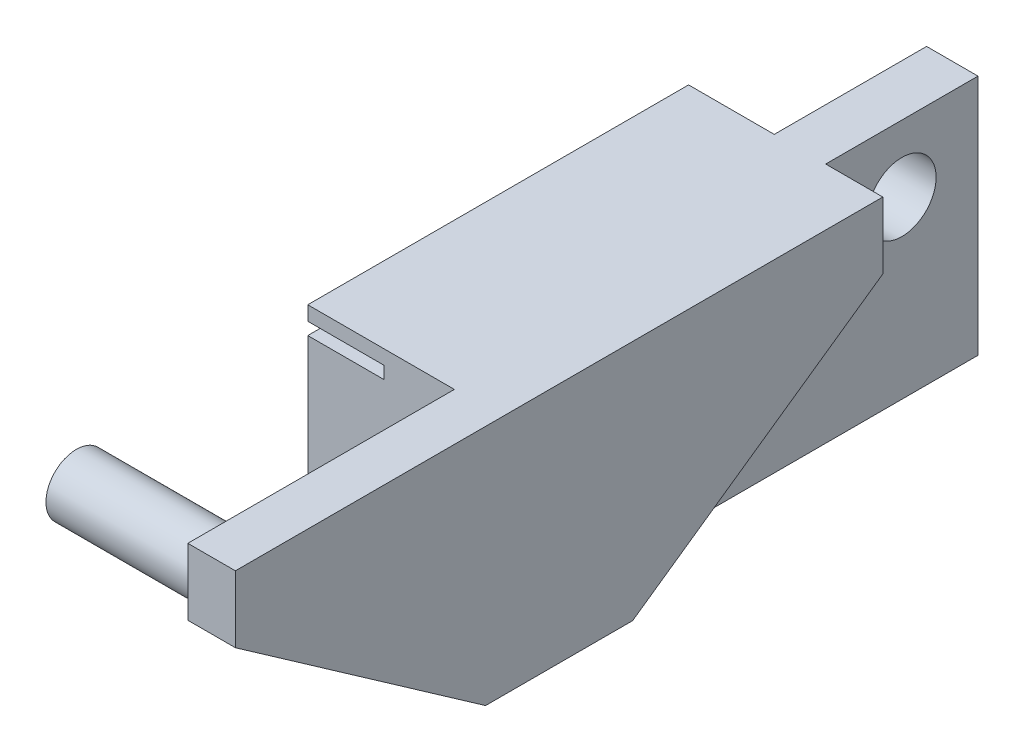
ISO-10303-21;
HEADER;
FILE_DESCRIPTION(('STEP AP214'),'2;1');
FILE_NAME('part.step','',(''),(''),'','','');
FILE_SCHEMA(('AUTOMOTIVE_DESIGN { 1 0 10303 214 1 1 1 1 }'));
ENDSEC;
DATA;
#1=APPLICATION_CONTEXT('core data for automotive mechanical design processes');
#2=APPLICATION_PROTOCOL_DEFINITION('international standard','automotive_design',2000,#1);
#3=PRODUCT_CONTEXT('',#1,'mechanical');
#4=PRODUCT('Part','Part','',(#3));
#5=PRODUCT_RELATED_PRODUCT_CATEGORY('part','',(#4));
#6=PRODUCT_DEFINITION_FORMATION('','',#4);
#7=PRODUCT_DEFINITION_CONTEXT('part definition',#1,'design');
#8=PRODUCT_DEFINITION('design','',#6,#7);
#9=PRODUCT_DEFINITION_SHAPE('','',#8);
#10=(LENGTH_UNIT() NAMED_UNIT(*) SI_UNIT(.MILLI.,.METRE.));
#11=(NAMED_UNIT(*) PLANE_ANGLE_UNIT() SI_UNIT($,.RADIAN.));
#12=(NAMED_UNIT(*) SI_UNIT($,.STERADIAN.) SOLID_ANGLE_UNIT());
#13=UNCERTAINTY_MEASURE_WITH_UNIT(LENGTH_MEASURE(1.E-05),#10,'distance_accuracy_value','');
#14=(GEOMETRIC_REPRESENTATION_CONTEXT(3) GLOBAL_UNCERTAINTY_ASSIGNED_CONTEXT((#13)) GLOBAL_UNIT_ASSIGNED_CONTEXT((#10,
#11,#12)) REPRESENTATION_CONTEXT('',''));
#15=CARTESIAN_POINT('',(0.,0.,0.));
#16=DIRECTION('',(0.,0.,1.));
#17=DIRECTION('',(1.,0.,0.));
#18=AXIS2_PLACEMENT_3D('',#15,#16,#17);
#19=CARTESIAN_POINT('',(-28.7781796503859,-0.00999999999999959,18.4558038197349));
#20=DIRECTION('',(1.,0.,0.));
#21=DIRECTION('',(0.,0.,-1.));
#22=AXIS2_PLACEMENT_3D('',#19,#20,#21);
#23=PLANE('',#22);
#24=CARTESIAN_POINT('',(-28.7781796503859,9.2,-12.2941961802651));
#25=DIRECTION('',(1.,0.,0.));
#26=DIRECTION('',(0.,0.,-1.));
#27=AXIS2_PLACEMENT_3D('',#24,#25,#26);
#28=CIRCLE('',#27,1.6);
#29=CARTESIAN_POINT('',(-28.7781796503859,9.2,-13.8941961802651));
#30=VERTEX_POINT('',#29);
#31=EDGE_CURVE('E454',#30,#30,#28,.F.);
#32=ORIENTED_EDGE('',*,*,#31,.F.);
#33=EDGE_LOOP('',(#32));
#34=FACE_BOUND('',#33,.T.);
#35=DIRECTION('',(0.,-1.,0.));
#36=VECTOR('',#35,1.);
#37=CARTESIAN_POINT('',(-28.7781796503859,12.7,4.45580381973494));
#38=LINE('',#37,#36);
#39=CARTESIAN_POINT('',(-28.7781796503859,11.3,4.45580381973494));
#40=VERTEX_POINT('',#39);
#41=CARTESIAN_POINT('',(-28.7781796503859,0.,4.45580381973494));
#42=VERTEX_POINT('',#41);
#43=EDGE_CURVE('E437',#40,#42,#38,.T.);
#44=ORIENTED_EDGE('',*,*,#43,.F.);
#45=DIRECTION('',(0.,0.,1.));
#46=VECTOR('',#45,1.);
#47=CARTESIAN_POINT('',(-28.7781796503859,11.3,4.45580381973494));
#48=LINE('',#47,#46);
#49=CARTESIAN_POINT('',(-28.7781796503859,11.3,-5.54419618026506));
#50=VERTEX_POINT('',#49);
#51=EDGE_CURVE('E250',#50,#40,#48,.T.);
#52=ORIENTED_EDGE('',*,*,#51,.F.);
#53=DIRECTION('',(0.,-1.,0.));
#54=VECTOR('',#53,1.);
#55=CARTESIAN_POINT('',(-28.7781796503859,11.3,-5.54419618026506));
#56=LINE('',#55,#54);
#57=CARTESIAN_POINT('',(-28.7781796503859,11.5,-5.54419618026506));
#58=VERTEX_POINT('',#57);
#59=EDGE_CURVE('E538',#58,#50,#56,.T.);
#60=ORIENTED_EDGE('',*,*,#59,.F.);
#61=DIRECTION('',(0.,0.,1.));
#62=VECTOR('',#61,1.);
#63=CARTESIAN_POINT('',(-28.7781796503859,11.5,-15.5441961802651));
#64=LINE('',#63,#62);
#65=CARTESIAN_POINT('',(-28.7781796503859,11.5,-15.5441961802651));
#66=VERTEX_POINT('',#65);
#67=EDGE_CURVE('E294',#66,#58,#64,.T.);
#68=ORIENTED_EDGE('',*,*,#67,.F.);
#69=DIRECTION('',(0.,-1.,0.));
#70=VECTOR('',#69,1.);
#71=CARTESIAN_POINT('',(-28.7781796503859,12.7,-15.5441961802651));
#72=LINE('',#71,#70);
#73=CARTESIAN_POINT('',(-28.7781796503859,9.2,-15.5441961802651));
#74=VERTEX_POINT('',#73);
#75=EDGE_CURVE('E450',#66,#74,#72,.T.);
#76=ORIENTED_EDGE('',*,*,#75,.T.);
#77=DIRECTION('',(0.,-0.57357643635105,0.819152044288989));
#78=VECTOR('',#77,1.);
#79=CARTESIAN_POINT('',(-28.7781796503859,9.2,-15.5441961802651));
#80=LINE('',#79,#78);
#81=CARTESIAN_POINT('',(-28.7781796503859,0.,-2.40523451823775));
#82=VERTEX_POINT('',#81);
#83=EDGE_CURVE('E446',#74,#82,#80,.T.);
#84=ORIENTED_EDGE('',*,*,#83,.T.);
#85=DIRECTION('',(0.,0.,-1.));
#86=VECTOR('',#85,1.);
#87=CARTESIAN_POINT('',(-28.7781796503859,0.,0.));
#88=LINE('',#87,#86);
#89=EDGE_CURVE('E442',#42,#82,#88,.T.);
#90=ORIENTED_EDGE('',*,*,#89,.F.);
#91=EDGE_LOOP('',(#44,#52,#60,#68,#76,#84,#90));
#92=FACE_BOUND('',#91,.T.);
#93=ADVANCED_FACE('F45',(#34,#92),#23,.F.);
#94=DIRECTION('',(0.,1.,0.));
#95=VECTOR('',#94,1.);
#96=CARTESIAN_POINT('',(-28.7781796503859,11.5,-5.54419618026507));
#97=LINE('',#96,#95);
#98=CARTESIAN_POINT('',(-28.7781796503859,11.95,-5.54419618026506));
#99=VERTEX_POINT('',#98);
#100=CARTESIAN_POINT('',(-28.7781796503859,12.15,-5.54419618026507));
#101=VERTEX_POINT('',#100);
#102=EDGE_CURVE('E318',#99,#101,#97,.T.);
#103=ORIENTED_EDGE('',*,*,#102,.F.);
#104=DIRECTION('',(0.,0.,-1.));
#105=VECTOR('',#104,1.);
#106=CARTESIAN_POINT('',(-28.7781796503859,11.95,4.45580381973494));
#107=LINE('',#106,#105);
#108=CARTESIAN_POINT('',(-28.7781796503859,11.95,4.45580381973494));
#109=VERTEX_POINT('',#108);
#110=EDGE_CURVE('E540',#109,#99,#107,.T.);
#111=ORIENTED_EDGE('',*,*,#110,.F.);
#112=CARTESIAN_POINT('',(-28.7781796503859,12.7,4.45580381973494));
#113=VERTEX_POINT('',#112);
#114=EDGE_CURVE('E255',#113,#109,#38,.T.);
#115=ORIENTED_EDGE('',*,*,#114,.F.);
#116=DIRECTION('',(0.,0.,-1.));
#117=VECTOR('',#116,1.);
#118=CARTESIAN_POINT('',(-28.7781796503859,12.7,0.));
#119=LINE('',#118,#117);
#120=CARTESIAN_POINT('',(-28.7781796503859,12.7,-15.5441961802651));
#121=VERTEX_POINT('',#120);
#122=EDGE_CURVE('E443',#113,#121,#119,.T.);
#123=ORIENTED_EDGE('',*,*,#122,.T.);
#124=CARTESIAN_POINT('',(-28.7781796503859,12.15,-15.5441961802651));
#125=VERTEX_POINT('',#124);
#126=EDGE_CURVE('E447',#121,#125,#72,.T.);
#127=ORIENTED_EDGE('',*,*,#126,.T.);
#128=DIRECTION('',(0.,0.,-1.));
#129=VECTOR('',#128,1.);
#130=CARTESIAN_POINT('',(-28.7781796503859,12.15,-15.5441961802651));
#131=LINE('',#130,#129);
#132=EDGE_CURVE('E306',#101,#125,#131,.T.);
#133=ORIENTED_EDGE('',*,*,#132,.F.);
#134=EDGE_LOOP('',(#103,#111,#115,#123,#127,#133));
#135=FACE_BOUND('',#134,.T.);
#136=ADVANCED_FACE('F47',(#135),#23,.F.);
#137=CARTESIAN_POINT('',(0.,0.,0.));
#138=DIRECTION('',(0.,1.,0.));
#139=DIRECTION('',(0.,0.,1.));
#140=AXIS2_PLACEMENT_3D('',#137,#138,#139);
#141=PLANE('',#140);
#142=DIRECTION('',(0.,0.,1.));
#143=VECTOR('',#142,1.);
#144=CARTESIAN_POINT('',(-21.5781796503859,0.,0.));
#145=LINE('',#144,#143);
#146=CARTESIAN_POINT('',(-21.5781796503859,0.,-23.5441961802651));
#147=VERTEX_POINT('',#146);
#148=CARTESIAN_POINT('',(-21.5781796503859,0.,-2.40523451823775));
#149=VERTEX_POINT('',#148);
#150=EDGE_CURVE('E413',#147,#149,#145,.T.);
#151=ORIENTED_EDGE('',*,*,#150,.T.);
#152=DIRECTION('',(1.,0.,0.));
#153=VECTOR('',#152,1.);
#154=CARTESIAN_POINT('',(-21.5781796503859,0.,-2.40523451823775));
#155=LINE('',#154,#153);
#156=CARTESIAN_POINT('',(-18.5781796503859,0.,-2.40523451823775));
#157=VERTEX_POINT('',#156);
#158=EDGE_CURVE('E360',#149,#157,#155,.T.);
#159=ORIENTED_EDGE('',*,*,#158,.T.);
#160=DIRECTION('',(0.,0.,1.));
#161=VECTOR('',#160,1.);
#162=CARTESIAN_POINT('',(-18.5781796503859,0.,0.));
#163=LINE('',#162,#161);
#164=CARTESIAN_POINT('',(-18.5781796503859,0.,5.31684215770762));
#165=VERTEX_POINT('',#164);
#166=EDGE_CURVE('E411',#157,#165,#163,.T.);
#167=ORIENTED_EDGE('',*,*,#166,.T.);
#168=DIRECTION('',(1.,0.,0.));
#169=VECTOR('',#168,1.);
#170=CARTESIAN_POINT('',(0.,0.,5.31684215770762));
#171=LINE('',#170,#169);
#172=CARTESIAN_POINT('',(-21.0781796503859,0.,5.31684215770762));
#173=VERTEX_POINT('',#172);
#174=EDGE_CURVE('E439',#173,#165,#171,.T.);
#175=ORIENTED_EDGE('',*,*,#174,.F.);
#176=DIRECTION('',(0.,0.,1.));
#177=VECTOR('',#176,1.);
#178=CARTESIAN_POINT('',(-21.0781796503859,0.,0.));
#179=LINE('',#178,#177);
#180=CARTESIAN_POINT('',(-21.0781796503859,0.,4.45580381973494));
#181=VERTEX_POINT('',#180);
#182=EDGE_CURVE('E408',#181,#173,#179,.T.);
#183=ORIENTED_EDGE('',*,*,#182,.F.);
#184=DIRECTION('',(1.,0.,0.));
#185=VECTOR('',#184,1.);
#186=CARTESIAN_POINT('',(0.,0.,4.45580381973494));
#187=LINE('',#186,#185);
#188=EDGE_CURVE('E386',#42,#181,#187,.T.);
#189=ORIENTED_EDGE('',*,*,#188,.F.);
#190=ORIENTED_EDGE('',*,*,#89,.T.);
#191=DIRECTION('',(-1.,0.,0.));
#192=VECTOR('',#191,1.);
#193=CARTESIAN_POINT('',(-28.2781796503859,0.,-2.40523451823775));
#194=LINE('',#193,#192);
#195=CARTESIAN_POINT('',(-28.2781796503859,0.,-2.40523451823775));
#196=VERTEX_POINT('',#195);
#197=EDGE_CURVE('E356',#196,#82,#194,.T.);
#198=ORIENTED_EDGE('',*,*,#197,.F.);
#199=DIRECTION('',(0.,0.,1.));
#200=VECTOR('',#199,1.);
#201=CARTESIAN_POINT('',(-28.2781796503859,0.,0.));
#202=LINE('',#201,#200);
#203=CARTESIAN_POINT('',(-28.2781796503859,0.,-15.5441961802651));
#204=VERTEX_POINT('',#203);
#205=EDGE_CURVE('E390',#204,#196,#202,.T.);
#206=ORIENTED_EDGE('',*,*,#205,.F.);
#207=DIRECTION('',(1.,0.,0.));
#208=VECTOR('',#207,1.);
#209=CARTESIAN_POINT('',(-28.2781796503859,0.,-15.5441961802651));
#210=LINE('',#209,#208);
#211=CARTESIAN_POINT('',(-24.2781796503859,0.,-15.5441961802651));
#212=VERTEX_POINT('',#211);
#213=EDGE_CURVE('E331',#204,#212,#210,.T.);
#214=ORIENTED_EDGE('',*,*,#213,.T.);
#215=DIRECTION('',(0.,0.,-1.));
#216=VECTOR('',#215,1.);
#217=CARTESIAN_POINT('',(-24.2781796503859,0.,-23.5441961802651));
#218=LINE('',#217,#216);
#219=CARTESIAN_POINT('',(-24.2781796503859,0.,-23.5441961802651));
#220=VERTEX_POINT('',#219);
#221=EDGE_CURVE('E334',#212,#220,#218,.T.);
#222=ORIENTED_EDGE('',*,*,#221,.T.);
#223=DIRECTION('',(1.,0.,0.));
#224=VECTOR('',#223,1.);
#225=CARTESIAN_POINT('',(0.,0.,-23.5441961802651));
#226=LINE('',#225,#224);
#227=CARTESIAN_POINT('',(-23.6781796503859,0.,-23.5441961802651));
#228=VERTEX_POINT('',#227);
#229=EDGE_CURVE('E416',#220,#228,#226,.T.);
#230=ORIENTED_EDGE('',*,*,#229,.T.);
#231=DIRECTION('',(0.,0.,-1.));
#232=VECTOR('',#231,1.);
#233=CARTESIAN_POINT('',(-23.6781796503859,0.,4.45580381973494));
#234=LINE('',#233,#232);
#235=CARTESIAN_POINT('',(-23.6781796503859,0.,-2.40523451823775));
#236=VERTEX_POINT('',#235);
#237=EDGE_CURVE('E276',#236,#228,#234,.T.);
#238=ORIENTED_EDGE('',*,*,#237,.F.);
#239=DIRECTION('',(1.,0.,0.));
#240=VECTOR('',#239,1.);
#241=CARTESIAN_POINT('',(-28.7781796503859,0.,-2.40523451823775));
#242=LINE('',#241,#240);
#243=CARTESIAN_POINT('',(-22.1781796503859,0.,-2.40523451823775));
#244=VERTEX_POINT('',#243);
#245=EDGE_CURVE('E267',#236,#244,#242,.T.);
#246=ORIENTED_EDGE('',*,*,#245,.T.);
#247=DIRECTION('',(0.,0.,1.));
#248=VECTOR('',#247,1.);
#249=CARTESIAN_POINT('',(-22.1781796503859,0.,4.45580381973494));
#250=LINE('',#249,#248);
#251=CARTESIAN_POINT('',(-22.1781796503859,0.,-23.5441961802651));
#252=VERTEX_POINT('',#251);
#253=EDGE_CURVE('E280',#252,#244,#250,.T.);
#254=ORIENTED_EDGE('',*,*,#253,.F.);
#255=EDGE_CURVE('E415',#252,#147,#226,.T.);
#256=ORIENTED_EDGE('',*,*,#255,.T.);
#257=EDGE_LOOP('',(#151,#159,#167,#175,#183,#189,#190,#198,#206,#214,#222,#230,#238,#246,#254,#256));
#258=FACE_BOUND('',#257,.T.);
#259=ADVANCED_FACE('F476',(#258),#141,.F.);
#260=CARTESIAN_POINT('',(0.,12.7,-15.5441961802651));
#261=DIRECTION('',(0.,0.,-1.));
#262=DIRECTION('',(-1.,0.,0.));
#263=AXIS2_PLACEMENT_3D('',#260,#261,#262);
#264=PLANE('',#263);
#265=DIRECTION('',(-1.,0.,0.));
#266=VECTOR('',#265,1.);
#267=CARTESIAN_POINT('',(-28.1281796503859,12.15,-15.5441961802651));
#268=LINE('',#267,#266);
#269=CARTESIAN_POINT('',(-28.1281796503859,12.15,-15.5441961802651));
#270=VERTEX_POINT('',#269);
#271=EDGE_CURVE('E321',#270,#125,#268,.T.);
#272=ORIENTED_EDGE('',*,*,#271,.T.);
#273=ORIENTED_EDGE('',*,*,#126,.F.);
#274=DIRECTION('',(1.,0.,0.));
#275=VECTOR('',#274,1.);
#276=CARTESIAN_POINT('',(0.,12.7,-15.5441961802651));
#277=LINE('',#276,#275);
#278=CARTESIAN_POINT('',(-24.2781796503859,12.7,-15.5441961802651));
#279=VERTEX_POINT('',#278);
#280=EDGE_CURVE('E401',#121,#279,#277,.T.);
#281=ORIENTED_EDGE('',*,*,#280,.T.);
#282=DIRECTION('',(0.,1.,0.));
#283=VECTOR('',#282,1.);
#284=CARTESIAN_POINT('',(-24.2781796503859,0.,-15.5441961802651));
#285=LINE('',#284,#283);
#286=EDGE_CURVE('E343',#212,#279,#285,.T.);
#287=ORIENTED_EDGE('',*,*,#286,.F.);
#288=ORIENTED_EDGE('',*,*,#213,.F.);
#289=DIRECTION('',(0.,1.,0.));
#290=VECTOR('',#289,1.);
#291=CARTESIAN_POINT('',(-28.2781796503859,0.,-15.5441961802651));
#292=LINE('',#291,#290);
#293=CARTESIAN_POINT('',(-28.2781796503859,9.2,-15.5441961802651));
#294=VERTEX_POINT('',#293);
#295=EDGE_CURVE('E337',#204,#294,#292,.T.);
#296=ORIENTED_EDGE('',*,*,#295,.T.);
#297=DIRECTION('',(-1.,0.,0.));
#298=VECTOR('',#297,1.);
#299=CARTESIAN_POINT('',(-28.2781796503859,9.2,-15.5441961802651));
#300=LINE('',#299,#298);
#301=EDGE_CURVE('E357',#294,#74,#300,.T.);
#302=ORIENTED_EDGE('',*,*,#301,.T.);
#303=ORIENTED_EDGE('',*,*,#75,.F.);
#304=DIRECTION('',(-1.,0.,0.));
#305=VECTOR('',#304,1.);
#306=CARTESIAN_POINT('',(-28.1281796503859,11.5,-15.5441961802651));
#307=LINE('',#306,#305);
#308=CARTESIAN_POINT('',(-28.1281796503859,11.5,-15.5441961802651));
#309=VERTEX_POINT('',#308);
#310=EDGE_CURVE('E315',#309,#66,#307,.T.);
#311=ORIENTED_EDGE('',*,*,#310,.F.);
#312=DIRECTION('',(0.,-1.,0.));
#313=VECTOR('',#312,1.);
#314=CARTESIAN_POINT('',(-28.1281796503859,11.5,-15.5441961802651));
#315=LINE('',#314,#313);
#316=EDGE_CURVE('E302',#270,#309,#315,.T.);
#317=ORIENTED_EDGE('',*,*,#316,.F.);
#318=EDGE_LOOP('',(#272,#273,#281,#287,#288,#296,#302,#303,#311,#317));
#319=FACE_BOUND('',#318,.T.);
#320=ADVANCED_FACE('F511',(#319),#264,.T.);
#321=CARTESIAN_POINT('',(-21.0781796503859,12.7,0.));
#322=DIRECTION('',(1.,0.,0.));
#323=DIRECTION('',(0.,0.,-1.));
#324=AXIS2_PLACEMENT_3D('',#321,#322,#323);
#325=PLANE('',#324);
#326=CARTESIAN_POINT('',(-21.0781796503859,9.2,15.2058038197349));
#327=DIRECTION('',(1.,0.,0.));
#328=DIRECTION('',(0.,0.,-1.));
#329=AXIS2_PLACEMENT_3D('',#326,#327,#328);
#330=CIRCLE('',#329,1.6);
#331=CARTESIAN_POINT('',(-21.0781796503859,9.2,13.6058038197349));
#332=VERTEX_POINT('',#331);
#333=EDGE_CURVE('E380',#332,#332,#330,.T.);
#334=ORIENTED_EDGE('',*,*,#333,.T.);
#335=EDGE_LOOP('',(#334));
#336=FACE_BOUND('',#335,.T.);
#337=DIRECTION('',(0.,-0.57357643635105,-0.819152044288989));
#338=VECTOR('',#337,1.);
#339=CARTESIAN_POINT('',(-21.0781796503859,1.68007341914141,7.71623566243481));
#340=LINE('',#339,#338);
#341=CARTESIAN_POINT('',(-21.0781796503859,9.2,18.4558038197349));
#342=VERTEX_POINT('',#341);
#343=EDGE_CURVE('E370',#342,#173,#340,.T.);
#344=ORIENTED_EDGE('',*,*,#343,.F.);
#345=DIRECTION('',(0.,-1.,0.));
#346=VECTOR('',#345,1.);
#347=CARTESIAN_POINT('',(-21.0781796503859,12.7,18.4558038197349));
#348=LINE('',#347,#346);
#349=CARTESIAN_POINT('',(-21.0781796503859,12.7,18.4558038197349));
#350=VERTEX_POINT('',#349);
#351=EDGE_CURVE('E432',#350,#342,#348,.T.);
#352=ORIENTED_EDGE('',*,*,#351,.F.);
#353=DIRECTION('',(0.,0.,1.));
#354=VECTOR('',#353,1.);
#355=CARTESIAN_POINT('',(-21.0781796503859,12.7,0.));
#356=LINE('',#355,#354);
#357=CARTESIAN_POINT('',(-21.0781796503859,12.7,4.45580381973494));
#358=VERTEX_POINT('',#357);
#359=EDGE_CURVE('E389',#358,#350,#356,.T.);
#360=ORIENTED_EDGE('',*,*,#359,.F.);
#361=DIRECTION('',(0.,-1.,0.));
#362=VECTOR('',#361,1.);
#363=CARTESIAN_POINT('',(-21.0781796503859,12.7,4.45580381973494));
#364=LINE('',#363,#362);
#365=EDGE_CURVE('E435',#358,#181,#364,.T.);
#366=ORIENTED_EDGE('',*,*,#365,.T.);
#367=ORIENTED_EDGE('',*,*,#182,.T.);
#368=EDGE_LOOP('',(#344,#352,#360,#366,#367));
#369=FACE_BOUND('',#368,.T.);
#370=ADVANCED_FACE('F560',(#336,#369),#325,.F.);
#371=CARTESIAN_POINT('',(0.,12.7,18.4558038197349));
#372=DIRECTION('',(0.,0.,-1.));
#373=DIRECTION('',(-1.,0.,0.));
#374=AXIS2_PLACEMENT_3D('',#371,#372,#373);
#375=PLANE('',#374);
#376=DIRECTION('',(1.,0.,0.));
#377=VECTOR('',#376,1.);
#378=CARTESIAN_POINT('',(-21.5781796503859,9.2,18.4558038197349));
#379=LINE('',#378,#377);
#380=CARTESIAN_POINT('',(-18.5781796503859,9.2,18.4558038197349));
#381=VERTEX_POINT('',#380);
#382=EDGE_CURVE('E366',#342,#381,#379,.T.);
#383=ORIENTED_EDGE('',*,*,#382,.T.);
#384=DIRECTION('',(0.,-1.,0.));
#385=VECTOR('',#384,1.);
#386=CARTESIAN_POINT('',(-18.5781796503859,12.7,18.4558038197349));
#387=LINE('',#386,#385);
#388=CARTESIAN_POINT('',(-18.5781796503859,12.7,18.4558038197349));
#389=VERTEX_POINT('',#388);
#390=EDGE_CURVE('E429',#389,#381,#387,.T.);
#391=ORIENTED_EDGE('',*,*,#390,.F.);
#392=DIRECTION('',(1.,0.,0.));
#393=VECTOR('',#392,1.);
#394=CARTESIAN_POINT('',(0.,12.7,18.4558038197349));
#395=LINE('',#394,#393);
#396=EDGE_CURVE('E392',#350,#389,#395,.T.);
#397=ORIENTED_EDGE('',*,*,#396,.F.);
#398=ORIENTED_EDGE('',*,*,#351,.T.);
#399=EDGE_LOOP('',(#383,#391,#397,#398));
#400=FACE_BOUND('',#399,.T.);
#401=ADVANCED_FACE('F512',(#400),#375,.F.);
#402=CARTESIAN_POINT('',(-18.5781796503859,12.7,0.));
#403=DIRECTION('',(1.,0.,0.));
#404=DIRECTION('',(0.,0.,-1.));
#405=AXIS2_PLACEMENT_3D('',#402,#403,#404);
#406=PLANE('',#405);
#407=DIRECTION('',(0.,-0.57357643635105,-0.819152044288989));
#408=VECTOR('',#407,1.);
#409=CARTESIAN_POINT('',(-18.5781796503859,9.2,18.4558038197349));
#410=LINE('',#409,#408);
#411=EDGE_CURVE('E363',#381,#165,#410,.T.);
#412=ORIENTED_EDGE('',*,*,#411,.T.);
#413=ORIENTED_EDGE('',*,*,#166,.F.);
#414=DIRECTION('',(0.,-0.57357643635105,0.819152044288989));
#415=VECTOR('',#414,1.);
#416=CARTESIAN_POINT('',(-18.5781796503859,9.2,-15.5441961802651));
#417=LINE('',#416,#415);
#418=CARTESIAN_POINT('',(-18.5781796503859,9.2,-15.5441961802651));
#419=VERTEX_POINT('',#418);
#420=EDGE_CURVE('E367',#419,#157,#417,.T.);
#421=ORIENTED_EDGE('',*,*,#420,.F.);
#422=DIRECTION('',(0.,-1.,0.));
#423=VECTOR('',#422,1.);
#424=CARTESIAN_POINT('',(-18.5781796503859,12.7,-15.5441961802651));
#425=LINE('',#424,#423);
#426=CARTESIAN_POINT('',(-18.5781796503859,12.7,-15.5441961802651));
#427=VERTEX_POINT('',#426);
#428=EDGE_CURVE('E426',#427,#419,#425,.T.);
#429=ORIENTED_EDGE('',*,*,#428,.F.);
#430=DIRECTION('',(0.,0.,1.));
#431=VECTOR('',#430,1.);
#432=CARTESIAN_POINT('',(-18.5781796503859,12.7,0.));
#433=LINE('',#432,#431);
#434=EDGE_CURVE('E394',#427,#389,#433,.T.);
#435=ORIENTED_EDGE('',*,*,#434,.T.);
#436=ORIENTED_EDGE('',*,*,#390,.T.);
#437=EDGE_LOOP('',(#412,#413,#421,#429,#435,#436));
#438=FACE_BOUND('',#437,.T.);
#439=ADVANCED_FACE('F504',(#438),#406,.T.);
#440=CARTESIAN_POINT('',(0.,12.7,4.45580381973494));
#441=DIRECTION('',(0.,0.,-1.));
#442=DIRECTION('',(-1.,0.,0.));
#443=AXIS2_PLACEMENT_3D('',#440,#441,#442);
#444=PLANE('',#443);
#445=DIRECTION('',(0.,-1.,0.));
#446=VECTOR('',#445,1.);
#447=CARTESIAN_POINT('',(-22.1781796503859,3.,4.45580381973494));
#448=LINE('',#447,#446);
#449=CARTESIAN_POINT('',(-22.1781796503859,3.,4.45580381973494));
#450=VERTEX_POINT('',#449);
#451=CARTESIAN_POINT('',(-22.1781796503859,1.,4.45580381973494));
#452=VERTEX_POINT('',#451);
#453=EDGE_CURVE('E295',#450,#452,#448,.T.);
#454=ORIENTED_EDGE('',*,*,#453,.T.);
#455=DIRECTION('',(-1.,0.,0.));
#456=VECTOR('',#455,1.);
#457=CARTESIAN_POINT('',(-28.7781796503859,1.,4.45580381973494));
#458=LINE('',#457,#456);
#459=CARTESIAN_POINT('',(-23.6781796503859,1.,4.45580381973494));
#460=VERTEX_POINT('',#459);
#461=EDGE_CURVE('E266',#452,#460,#458,.T.);
#462=ORIENTED_EDGE('',*,*,#461,.T.);
#463=DIRECTION('',(0.,-1.,0.));
#464=VECTOR('',#463,1.);
#465=CARTESIAN_POINT('',(-23.6781796503859,3.,4.45580381973494));
#466=LINE('',#465,#464);
#467=CARTESIAN_POINT('',(-23.6781796503859,3.,4.45580381973494));
#468=VERTEX_POINT('',#467);
#469=EDGE_CURVE('E292',#468,#460,#466,.T.);
#470=ORIENTED_EDGE('',*,*,#469,.F.);
#471=DIRECTION('',(-1.,0.,0.));
#472=VECTOR('',#471,1.);
#473=CARTESIAN_POINT('',(-23.6781796503859,3.,4.45580381973494));
#474=LINE('',#473,#472);
#475=EDGE_CURVE('E286',#450,#468,#474,.T.);
#476=ORIENTED_EDGE('',*,*,#475,.F.);
#477=EDGE_LOOP('',(#454,#462,#470,#476));
#478=FACE_BOUND('',#477,.T.);
#479=DIRECTION('',(0.,1.,0.));
#480=VECTOR('',#479,1.);
#481=CARTESIAN_POINT('',(-24.7781796503859,11.3,4.45580381973494));
#482=LINE('',#481,#480);
#483=CARTESIAN_POINT('',(-24.7781796503859,11.3,4.45580381973494));
#484=VERTEX_POINT('',#483);
#485=CARTESIAN_POINT('',(-24.7781796503859,11.95,4.45580381973494));
#486=VERTEX_POINT('',#485);
#487=EDGE_CURVE('E241',#484,#486,#482,.T.);
#488=ORIENTED_EDGE('',*,*,#487,.F.);
#489=DIRECTION('',(-1.,0.,0.));
#490=VECTOR('',#489,1.);
#491=CARTESIAN_POINT('',(-24.7781796503859,11.3,4.45580381973494));
#492=LINE('',#491,#490);
#493=EDGE_CURVE('E272',#484,#40,#492,.T.);
#494=ORIENTED_EDGE('',*,*,#493,.T.);
#495=ORIENTED_EDGE('',*,*,#43,.T.);
#496=ORIENTED_EDGE('',*,*,#188,.T.);
#497=ORIENTED_EDGE('',*,*,#365,.F.);
#498=DIRECTION('',(1.,0.,0.));
#499=VECTOR('',#498,1.);
#500=CARTESIAN_POINT('',(0.,12.7,4.45580381973494));
#501=LINE('',#500,#499);
#502=EDGE_CURVE('E387',#113,#358,#501,.T.);
#503=ORIENTED_EDGE('',*,*,#502,.F.);
#504=ORIENTED_EDGE('',*,*,#114,.T.);
#505=DIRECTION('',(-1.,0.,0.));
#506=VECTOR('',#505,1.);
#507=CARTESIAN_POINT('',(-24.7781796503859,11.95,4.45580381973494));
#508=LINE('',#507,#506);
#509=EDGE_CURVE('E236',#486,#109,#508,.T.);
#510=ORIENTED_EDGE('',*,*,#509,.F.);
#511=EDGE_LOOP('',(#488,#494,#495,#496,#497,#503,#504,#510));
#512=FACE_BOUND('',#511,.T.);
#513=ADVANCED_FACE('F253',(#478,#512),#444,.F.);
#514=DIRECTION('',(1.,0.,0.));
#515=VECTOR('',#514,1.);
#516=CARTESIAN_POINT('',(-21.5781796503859,9.2,-15.5441961802651));
#517=LINE('',#516,#515);
#518=CARTESIAN_POINT('',(-21.5781796503859,9.2,-15.5441961802651));
#519=VERTEX_POINT('',#518);
#520=EDGE_CURVE('E371',#519,#419,#517,.T.);
#521=ORIENTED_EDGE('',*,*,#520,.F.);
#522=DIRECTION('',(0.,-1.,0.));
#523=VECTOR('',#522,1.);
#524=CARTESIAN_POINT('',(-21.5781796503859,12.7,-15.5441961802651));
#525=LINE('',#524,#523);
#526=CARTESIAN_POINT('',(-21.5781796503859,12.7,-15.5441961802651));
#527=VERTEX_POINT('',#526);
#528=EDGE_CURVE('E423',#527,#519,#525,.T.);
#529=ORIENTED_EDGE('',*,*,#528,.F.);
#530=EDGE_CURVE('E397',#527,#427,#277,.T.);
#531=ORIENTED_EDGE('',*,*,#530,.T.);
#532=ORIENTED_EDGE('',*,*,#428,.T.);
#533=EDGE_LOOP('',(#521,#529,#531,#532));
#534=FACE_BOUND('',#533,.T.);
#535=ADVANCED_FACE('F503',(#534),#264,.T.);
#536=CARTESIAN_POINT('',(-21.5781796503859,12.7,0.));
#537=DIRECTION('',(1.,0.,0.));
#538=DIRECTION('',(0.,0.,-1.));
#539=AXIS2_PLACEMENT_3D('',#536,#537,#538);
#540=PLANE('',#539);
#541=CARTESIAN_POINT('',(-21.5781796503859,9.2,-19.5441961802651));
#542=DIRECTION('',(1.,0.,0.));
#543=DIRECTION('',(0.,0.,-1.));
#544=AXIS2_PLACEMENT_3D('',#541,#542,#543);
#545=CIRCLE('',#544,1.8);
#546=CARTESIAN_POINT('',(-21.5781796503859,9.2,-21.3441961802651));
#547=VERTEX_POINT('',#546);
#548=EDGE_CURVE('E383',#547,#547,#545,.T.);
#549=ORIENTED_EDGE('',*,*,#548,.F.);
#550=EDGE_LOOP('',(#549));
#551=FACE_BOUND('',#550,.T.);
#552=ORIENTED_EDGE('',*,*,#150,.F.);
#553=DIRECTION('',(0.,-1.,0.));
#554=VECTOR('',#553,1.);
#555=CARTESIAN_POINT('',(-21.5781796503859,12.7,-23.5441961802651));
#556=LINE('',#555,#554);
#557=CARTESIAN_POINT('',(-21.5781796503859,12.7,-23.5441961802651));
#558=VERTEX_POINT('',#557);
#559=EDGE_CURVE('E420',#558,#147,#556,.T.);
#560=ORIENTED_EDGE('',*,*,#559,.F.);
#561=DIRECTION('',(0.,0.,1.));
#562=VECTOR('',#561,1.);
#563=CARTESIAN_POINT('',(-21.5781796503859,12.7,0.));
#564=LINE('',#563,#562);
#565=EDGE_CURVE('E400',#558,#527,#564,.T.);
#566=ORIENTED_EDGE('',*,*,#565,.T.);
#567=ORIENTED_EDGE('',*,*,#528,.T.);
#568=DIRECTION('',(0.,-0.57357643635105,0.819152044288989));
#569=VECTOR('',#568,1.);
#570=CARTESIAN_POINT('',(-21.5781796503859,9.2,-15.5441961802651));
#571=LINE('',#570,#569);
#572=EDGE_CURVE('E373',#519,#149,#571,.T.);
#573=ORIENTED_EDGE('',*,*,#572,.T.);
#574=EDGE_LOOP('',(#552,#560,#566,#567,#573));
#575=FACE_BOUND('',#574,.T.);
#576=ADVANCED_FACE('F493',(#551,#575),#540,.T.);
#577=CARTESIAN_POINT('',(0.,12.7,-23.5441961802651));
#578=DIRECTION('',(0.,0.,-1.));
#579=DIRECTION('',(-1.,0.,0.));
#580=AXIS2_PLACEMENT_3D('',#577,#578,#579);
#581=PLANE('',#580);
#582=DIRECTION('',(0.,-1.,0.));
#583=VECTOR('',#582,1.);
#584=CARTESIAN_POINT('',(-23.6781796503859,3.,-23.5441961802651));
#585=LINE('',#584,#583);
#586=CARTESIAN_POINT('',(-23.6781796503859,3.,-23.5441961802651));
#587=VERTEX_POINT('',#586);
#588=EDGE_CURVE('E289',#587,#228,#585,.T.);
#589=ORIENTED_EDGE('',*,*,#588,.T.);
#590=ORIENTED_EDGE('',*,*,#229,.F.);
#591=DIRECTION('',(0.,1.,0.));
#592=VECTOR('',#591,1.);
#593=CARTESIAN_POINT('',(-24.2781796503859,0.,-23.5441961802651));
#594=LINE('',#593,#592);
#595=CARTESIAN_POINT('',(-24.2781796503859,12.7,-23.5441961802651));
#596=VERTEX_POINT('',#595);
#597=EDGE_CURVE('E339',#220,#596,#594,.T.);
#598=ORIENTED_EDGE('',*,*,#597,.T.);
#599=DIRECTION('',(1.,0.,0.));
#600=VECTOR('',#599,1.);
#601=CARTESIAN_POINT('',(0.,12.7,-23.5441961802651));
#602=LINE('',#601,#600);
#603=EDGE_CURVE('E404',#596,#558,#602,.T.);
#604=ORIENTED_EDGE('',*,*,#603,.T.);
#605=ORIENTED_EDGE('',*,*,#559,.T.);
#606=ORIENTED_EDGE('',*,*,#255,.F.);
#607=DIRECTION('',(0.,-1.,0.));
#608=VECTOR('',#607,1.);
#609=CARTESIAN_POINT('',(-22.1781796503859,3.,-23.5441961802651));
#610=LINE('',#609,#608);
#611=CARTESIAN_POINT('',(-22.1781796503859,3.,-23.5441961802651));
#612=VERTEX_POINT('',#611);
#613=EDGE_CURVE('E298',#612,#252,#610,.T.);
#614=ORIENTED_EDGE('',*,*,#613,.F.);
#615=DIRECTION('',(1.,0.,0.));
#616=VECTOR('',#615,1.);
#617=CARTESIAN_POINT('',(-23.6781796503859,3.,-23.5441961802651));
#618=LINE('',#617,#616);
#619=EDGE_CURVE('E279',#587,#612,#618,.T.);
#620=ORIENTED_EDGE('',*,*,#619,.F.);
#621=EDGE_LOOP('',(#589,#590,#598,#604,#605,#606,#614,#620));
#622=FACE_BOUND('',#621,.T.);
#623=ADVANCED_FACE('F474',(#622),#581,.T.);
#624=CARTESIAN_POINT('',(-28.2781796503859,12.7,0.));
#625=DIRECTION('',(1.,0.,0.));
#626=DIRECTION('',(0.,0.,-1.));
#627=AXIS2_PLACEMENT_3D('',#624,#625,#626);
#628=PLANE('',#627);
#629=DIRECTION('',(0.,-0.57357643635105,0.819152044288989));
#630=VECTOR('',#629,1.);
#631=CARTESIAN_POINT('',(-28.2781796503859,9.2,-15.5441961802651));
#632=LINE('',#631,#630);
#633=EDGE_CURVE('E353',#294,#196,#632,.T.);
#634=ORIENTED_EDGE('',*,*,#633,.F.);
#635=ORIENTED_EDGE('',*,*,#295,.F.);
#636=ORIENTED_EDGE('',*,*,#205,.T.);
#637=EDGE_LOOP('',(#634,#635,#636));
#638=FACE_BOUND('',#637,.T.);
#639=ADVANCED_FACE('F578',(#638),#628,.F.);
#640=CARTESIAN_POINT('',(0.,12.7,0.));
#641=DIRECTION('',(0.,1.,0.));
#642=DIRECTION('',(0.,0.,1.));
#643=AXIS2_PLACEMENT_3D('',#640,#641,#642);
#644=PLANE('',#643);
#645=DIRECTION('',(0.,0.,-1.));
#646=VECTOR('',#645,1.);
#647=CARTESIAN_POINT('',(-24.2781796503859,12.7,-23.5441961802651));
#648=LINE('',#647,#646);
#649=EDGE_CURVE('E324',#279,#596,#648,.T.);
#650=ORIENTED_EDGE('',*,*,#649,.F.);
#651=ORIENTED_EDGE('',*,*,#280,.F.);
#652=ORIENTED_EDGE('',*,*,#122,.F.);
#653=ORIENTED_EDGE('',*,*,#502,.T.);
#654=ORIENTED_EDGE('',*,*,#359,.T.);
#655=ORIENTED_EDGE('',*,*,#396,.T.);
#656=ORIENTED_EDGE('',*,*,#434,.F.);
#657=ORIENTED_EDGE('',*,*,#530,.F.);
#658=ORIENTED_EDGE('',*,*,#565,.F.);
#659=ORIENTED_EDGE('',*,*,#603,.F.);
#660=EDGE_LOOP('',(#650,#651,#652,#653,#654,#655,#656,#657,#658,#659));
#661=FACE_BOUND('',#660,.T.);
#662=ADVANCED_FACE('F487',(#661),#644,.T.);
#663=CARTESIAN_POINT('',(-31.2781796503859,9.2,-19.5441961802651));
#664=DIRECTION('',(1.,0.,0.));
#665=DIRECTION('',(0.,0.,-1.));
#666=AXIS2_PLACEMENT_3D('',#663,#664,#665);
#667=CYLINDRICAL_SURFACE('',#666,1.8);
#668=CARTESIAN_POINT('',(-24.2781796503859,9.2,-19.5441961802651));
#669=DIRECTION('',(1.,0.,0.));
#670=DIRECTION('',(0.,0.,-1.));
#671=AXIS2_PLACEMENT_3D('',#668,#669,#670);
#672=CIRCLE('',#671,1.8);
#673=CARTESIAN_POINT('',(-24.2781796503859,9.2,-21.3441961802651));
#674=VERTEX_POINT('',#673);
#675=EDGE_CURVE('E342',#674,#674,#672,.F.);
#676=ORIENTED_EDGE('',*,*,#675,.T.);
#677=EDGE_LOOP('',(#676));
#678=FACE_BOUND('',#677,.T.);
#679=ORIENTED_EDGE('',*,*,#548,.T.);
#680=EDGE_LOOP('',(#679));
#681=FACE_BOUND('',#680,.T.);
#682=ADVANCED_FACE('F585',(#678,#681),#667,.F.);
#683=CARTESIAN_POINT('',(-31.2801796503859,9.2,15.2058038197349));
#684=DIRECTION('',(1.,0.,0.));
#685=DIRECTION('',(0.,0.,-1.));
#686=AXIS2_PLACEMENT_3D('',#683,#684,#685);
#687=CYLINDRICAL_SURFACE('',#686,1.6);
#688=CARTESIAN_POINT('',(-30.1781796503859,9.2,15.2058038197349));
#689=DIRECTION('',(-1.,0.,0.));
#690=DIRECTION('',(0.,0.,1.));
#691=AXIS2_PLACEMENT_3D('',#688,#689,#690);
#692=CIRCLE('',#691,1.6);
#693=CARTESIAN_POINT('',(-30.1781796503859,9.2,13.6058038197349));
#694=VERTEX_POINT('',#693);
#695=EDGE_CURVE('E350',#694,#694,#692,.T.);
#696=CARTESIAN_POINT('',(-21.0781796503859,9.2,13.6058038197349));
#697=CARTESIAN_POINT('',(-21.1729713170526,9.2,13.6058038197349));
#698=CARTESIAN_POINT('',(-21.2677629837193,9.2,13.6058038197349));
#699=CARTESIAN_POINT('',(-21.4573463170526,9.2,13.6058038197349));
#700=CARTESIAN_POINT('',(-21.5521379837193,9.2,13.6058038197349));
#701=CARTESIAN_POINT('',(-21.7417213170526,9.2,13.6058038197349));
#702=CARTESIAN_POINT('',(-21.8365129837193,9.2,13.6058038197349));
#703=CARTESIAN_POINT('',(-22.0260963170526,9.2,13.6058038197349));
#704=CARTESIAN_POINT('',(-22.1208879837193,9.2,13.6058038197349));
#705=CARTESIAN_POINT('',(-22.3104713170526,9.2,13.6058038197349));
#706=CARTESIAN_POINT('',(-22.4052629837193,9.2,13.6058038197349));
#707=CARTESIAN_POINT('',(-22.5948463170526,9.2,13.6058038197349));
#708=CARTESIAN_POINT('',(-22.6896379837193,9.2,13.6058038197349));
#709=CARTESIAN_POINT('',(-22.8792213170526,9.2,13.6058038197349));
#710=CARTESIAN_POINT('',(-22.9740129837193,9.2,13.6058038197349));
#711=CARTESIAN_POINT('',(-23.1635963170526,9.2,13.6058038197349));
#712=CARTESIAN_POINT('',(-23.2583879837193,9.2,13.6058038197349));
#713=CARTESIAN_POINT('',(-23.4479713170526,9.2,13.6058038197349));
#714=CARTESIAN_POINT('',(-23.5427629837193,9.2,13.6058038197349));
#715=CARTESIAN_POINT('',(-23.7323463170526,9.2,13.6058038197349));
#716=CARTESIAN_POINT('',(-23.8271379837193,9.2,13.6058038197349));
#717=CARTESIAN_POINT('',(-24.0167213170526,9.2,13.6058038197349));
#718=CARTESIAN_POINT('',(-24.1115129837193,9.2,13.6058038197349));
#719=CARTESIAN_POINT('',(-24.3010963170526,9.2,13.6058038197349));
#720=CARTESIAN_POINT('',(-24.3958879837193,9.2,13.6058038197349));
#721=CARTESIAN_POINT('',(-24.5854713170526,9.2,13.6058038197349));
#722=CARTESIAN_POINT('',(-24.6802629837193,9.2,13.6058038197349));
#723=CARTESIAN_POINT('',(-24.8698463170526,9.2,13.6058038197349));
#724=CARTESIAN_POINT('',(-24.9646379837193,9.2,13.6058038197349));
#725=CARTESIAN_POINT('',(-25.1542213170526,9.2,13.6058038197349));
#726=CARTESIAN_POINT('',(-25.2490129837193,9.2,13.6058038197349));
#727=CARTESIAN_POINT('',(-25.4385963170526,9.2,13.6058038197349));
#728=CARTESIAN_POINT('',(-25.5333879837193,9.2,13.6058038197349));
#729=CARTESIAN_POINT('',(-25.7229713170526,9.2,13.6058038197349));
#730=CARTESIAN_POINT('',(-25.8177629837193,9.2,13.6058038197349));
#731=CARTESIAN_POINT('',(-26.0073463170526,9.2,13.6058038197349));
#732=CARTESIAN_POINT('',(-26.1021379837193,9.2,13.6058038197349));
#733=CARTESIAN_POINT('',(-26.2917213170526,9.2,13.6058038197349));
#734=CARTESIAN_POINT('',(-26.3865129837193,9.2,13.6058038197349));
#735=CARTESIAN_POINT('',(-26.5760963170526,9.2,13.6058038197349));
#736=CARTESIAN_POINT('',(-26.6708879837193,9.2,13.6058038197349));
#737=CARTESIAN_POINT('',(-26.8604713170526,9.2,13.6058038197349));
#738=CARTESIAN_POINT('',(-26.9552629837193,9.2,13.6058038197349));
#739=CARTESIAN_POINT('',(-27.1448463170526,9.2,13.6058038197349));
#740=CARTESIAN_POINT('',(-27.2396379837193,9.2,13.6058038197349));
#741=CARTESIAN_POINT('',(-27.4292213170526,9.2,13.6058038197349));
#742=CARTESIAN_POINT('',(-27.5240129837193,9.2,13.6058038197349));
#743=CARTESIAN_POINT('',(-27.7135963170526,9.2,13.6058038197349));
#744=CARTESIAN_POINT('',(-27.8083879837193,9.2,13.6058038197349));
#745=CARTESIAN_POINT('',(-27.9979713170526,9.2,13.6058038197349));
#746=CARTESIAN_POINT('',(-28.0927629837193,9.2,13.6058038197349));
#747=CARTESIAN_POINT('',(-28.2823463170526,9.2,13.6058038197349));
#748=CARTESIAN_POINT('',(-28.3771379837193,9.2,13.6058038197349));
#749=CARTESIAN_POINT('',(-28.5667213170526,9.2,13.6058038197349));
#750=CARTESIAN_POINT('',(-28.6615129837193,9.2,13.6058038197349));
#751=CARTESIAN_POINT('',(-28.8510963170526,9.2,13.6058038197349));
#752=CARTESIAN_POINT('',(-28.9458879837193,9.2,13.6058038197349));
#753=CARTESIAN_POINT('',(-29.1354713170526,9.2,13.6058038197349));
#754=CARTESIAN_POINT('',(-29.2302629837193,9.2,13.6058038197349));
#755=CARTESIAN_POINT('',(-29.4198463170526,9.2,13.6058038197349));
#756=CARTESIAN_POINT('',(-29.5146379837193,9.2,13.6058038197349));
#757=CARTESIAN_POINT('',(-29.7042213170526,9.2,13.6058038197349));
#758=CARTESIAN_POINT('',(-29.7990129837193,9.2,13.6058038197349));
#759=CARTESIAN_POINT('',(-29.9885963170526,9.2,13.6058038197349));
#760=CARTESIAN_POINT('',(-30.0833879837193,9.2,13.6058038197349));
#761=CARTESIAN_POINT('',(-30.1781796503859,9.2,13.6058038197349));
#762=B_SPLINE_CURVE_WITH_KNOTS('',3,(#696,#697,#698,#699,#700,#701,#702,#703,#704,#705,#706,
#707,#708,#709,#710,#711,#712,#713,#714,#715,#716,#717,#718,#719,#720,#721,#722,#723,#724,#725,
#726,#727,#728,#729,#730,#731,#732,#733,#734,#735,#736,#737,#738,#739,#740,#741,#742,#743,#744,
#745,#746,#747,#748,#749,#750,#751,#752,#753,#754,#755,#756,#757,#758,#759,#760,#761),
.UNSPECIFIED.,.F.,.F.,(4,2,2,2,2,2,2,2,2,2,2,2,2,2,2,2,2,2,2,2,2,2,2,2,2,2,2,2,2,2,2,2,4),(0.,
0.284374999999996,0.56875,0.853124999999996,1.1375,1.421875,1.70625,1.990625,2.275,2.559375,
2.84375,3.128125,3.4125,3.696875,3.98125,4.26562499999999,4.55,4.834375,5.11875,
5.40312499999999,5.6875,5.97187499999999,6.25625,6.54062499999999,6.825,7.109375,7.39375,
7.678125,7.9625,8.246875,8.53125,8.815625,9.1),.UNSPECIFIED.);
#763=EDGE_CURVE('BSEAM602',#332,#694,#762,.T.);
#764=ORIENTED_EDGE('',*,*,#333,.F.);
#765=ORIENTED_EDGE('',*,*,#695,.F.);
#766=ORIENTED_EDGE('',*,*,#763,.T.);
#767=ORIENTED_EDGE('',*,*,#763,.F.);
#768=EDGE_LOOP('',(#764,#766,#765,#767));
#769=FACE_BOUND('',#768,.T.);
#770=ADVANCED_FACE('F602',(#769),#687,.T.);
#771=CARTESIAN_POINT('',(-21.5781796503859,9.2,-15.5441961802651));
#772=DIRECTION('',(0.,0.819152044288989,0.57357643635105));
#773=DIRECTION('',(0.,-0.57357643635105,0.819152044288989));
#774=AXIS2_PLACEMENT_3D('',#771,#772,#773);
#775=PLANE('',#774);
#776=ORIENTED_EDGE('',*,*,#420,.T.);
#777=ORIENTED_EDGE('',*,*,#158,.F.);
#778=ORIENTED_EDGE('',*,*,#572,.F.);
#779=ORIENTED_EDGE('',*,*,#520,.T.);
#780=EDGE_LOOP('',(#776,#777,#778,#779));
#781=FACE_BOUND('',#780,.T.);
#782=ADVANCED_FACE('F605',(#781),#775,.F.);
#783=CARTESIAN_POINT('',(-21.5781796503859,9.2,18.4558038197349));
#784=DIRECTION('',(0.,-0.819152044288989,0.57357643635105));
#785=DIRECTION('',(0.,-0.57357643635105,-0.819152044288989));
#786=AXIS2_PLACEMENT_3D('',#783,#784,#785);
#787=PLANE('',#786);
#788=ORIENTED_EDGE('',*,*,#343,.T.);
#789=ORIENTED_EDGE('',*,*,#174,.T.);
#790=ORIENTED_EDGE('',*,*,#411,.F.);
#791=ORIENTED_EDGE('',*,*,#382,.F.);
#792=EDGE_LOOP('',(#788,#789,#790,#791));
#793=FACE_BOUND('',#792,.T.);
#794=ADVANCED_FACE('F620',(#793),#787,.T.);
#795=CARTESIAN_POINT('',(-28.2781796503859,9.2,-15.5441961802651));
#796=DIRECTION('',(0.,-0.819152044288989,-0.57357643635105));
#797=DIRECTION('',(0.,0.57357643635105,-0.819152044288989));
#798=AXIS2_PLACEMENT_3D('',#795,#796,#797);
#799=PLANE('',#798);
#800=ORIENTED_EDGE('',*,*,#83,.F.);
#801=ORIENTED_EDGE('',*,*,#301,.F.);
#802=ORIENTED_EDGE('',*,*,#633,.T.);
#803=ORIENTED_EDGE('',*,*,#197,.T.);
#804=EDGE_LOOP('',(#800,#801,#802,#803));
#805=FACE_BOUND('',#804,.T.);
#806=ADVANCED_FACE('F522',(#805),#799,.T.);
#807=CARTESIAN_POINT('',(-30.1781796503859,9.2,15.2058038197349));
#808=DIRECTION('',(-1.,0.,0.));
#809=DIRECTION('',(0.,0.,1.));
#810=AXIS2_PLACEMENT_3D('',#807,#808,#809);
#811=PLANE('',#810);
#812=ORIENTED_EDGE('',*,*,#695,.T.);
#813=EDGE_LOOP('',(#812));
#814=FACE_BOUND('',#813,.T.);
#815=ADVANCED_FACE('F609',(#814),#811,.T.);
#816=CARTESIAN_POINT('',(-30.1781796503859,9.2,-12.2941961802651));
#817=DIRECTION('',(1.,0.,0.));
#818=DIRECTION('',(0.,0.,-1.));
#819=AXIS2_PLACEMENT_3D('',#816,#817,#818);
#820=CYLINDRICAL_SURFACE('',#819,1.6);
#821=CARTESIAN_POINT('',(-30.1781796503859,9.2,-12.2941961802651));
#822=DIRECTION('',(-1.,0.,0.));
#823=DIRECTION('',(0.,0.,-1.));
#824=AXIS2_PLACEMENT_3D('',#821,#822,#823);
#825=CIRCLE('',#824,1.6);
#826=CARTESIAN_POINT('',(-30.1781796503859,9.2,-13.8941961802651));
#827=VERTEX_POINT('',#826);
#828=EDGE_CURVE('E347',#827,#827,#825,.T.);
#829=ORIENTED_EDGE('',*,*,#828,.F.);
#830=EDGE_LOOP('',(#829));
#831=FACE_BOUND('',#830,.T.);
#832=ORIENTED_EDGE('',*,*,#31,.T.);
#833=EDGE_LOOP('',(#832));
#834=FACE_BOUND('',#833,.T.);
#835=ADVANCED_FACE('F611',(#831,#834),#820,.T.);
#836=CARTESIAN_POINT('',(-30.1781796503859,9.2,-12.2941961802651));
#837=DIRECTION('',(1.,0.,0.));
#838=DIRECTION('',(0.,0.,-1.));
#839=AXIS2_PLACEMENT_3D('',#836,#837,#838);
#840=PLANE('',#839);
#841=ORIENTED_EDGE('',*,*,#828,.T.);
#842=EDGE_LOOP('',(#841));
#843=FACE_BOUND('',#842,.T.);
#844=ADVANCED_FACE('F617',(#843),#840,.F.);
#845=CARTESIAN_POINT('',(-24.2781796503859,0.,-23.5441961802651));
#846=DIRECTION('',(1.,0.,0.));
#847=DIRECTION('',(0.,0.,-1.));
#848=AXIS2_PLACEMENT_3D('',#845,#846,#847);
#849=PLANE('',#848);
#850=ORIENTED_EDGE('',*,*,#649,.T.);
#851=ORIENTED_EDGE('',*,*,#597,.F.);
#852=ORIENTED_EDGE('',*,*,#221,.F.);
#853=ORIENTED_EDGE('',*,*,#286,.T.);
#854=EDGE_LOOP('',(#850,#851,#852,#853));
#855=FACE_BOUND('',#854,.T.);
#856=ORIENTED_EDGE('',*,*,#675,.F.);
#857=EDGE_LOOP('',(#856));
#858=FACE_BOUND('',#857,.T.);
#859=ADVANCED_FACE('F480',(#855,#858),#849,.F.);
#860=CARTESIAN_POINT('',(-28.1281796503859,12.15,-15.5441961802651));
#861=DIRECTION('',(0.,1.,0.));
#862=DIRECTION('',(0.,0.,1.));
#863=AXIS2_PLACEMENT_3D('',#860,#861,#862);
#864=PLANE('',#863);
#865=ORIENTED_EDGE('',*,*,#132,.T.);
#866=ORIENTED_EDGE('',*,*,#271,.F.);
#867=DIRECTION('',(0.,0.,-1.));
#868=VECTOR('',#867,1.);
#869=CARTESIAN_POINT('',(-28.1281796503859,12.15,-15.5441961802651));
#870=LINE('',#869,#868);
#871=CARTESIAN_POINT('',(-28.1281796503859,12.15,-5.54419618026507));
#872=VERTEX_POINT('',#871);
#873=EDGE_CURVE('E313',#872,#270,#870,.T.);
#874=ORIENTED_EDGE('',*,*,#873,.F.);
#875=DIRECTION('',(-1.,0.,0.));
#876=VECTOR('',#875,1.);
#877=CARTESIAN_POINT('',(-28.1281796503859,12.15,-5.54419618026507));
#878=LINE('',#877,#876);
#879=EDGE_CURVE('E325',#872,#101,#878,.T.);
#880=ORIENTED_EDGE('',*,*,#879,.T.);
#881=EDGE_LOOP('',(#865,#866,#874,#880));
#882=FACE_BOUND('',#881,.T.);
#883=ADVANCED_FACE('F575',(#882),#864,.F.);
#884=CARTESIAN_POINT('',(-28.1281796503859,11.5,-5.54419618026507));
#885=DIRECTION('',(0.,0.,1.));
#886=DIRECTION('',(1.,0.,0.));
#887=AXIS2_PLACEMENT_3D('',#884,#885,#886);
#888=PLANE('',#887);
#889=DIRECTION('',(0.,1.,0.));
#890=VECTOR('',#889,1.);
#891=CARTESIAN_POINT('',(-28.1281796503859,11.5,-5.54419618026507));
#892=LINE('',#891,#890);
#893=CARTESIAN_POINT('',(-28.1281796503859,11.95,-5.54419618026507));
#894=VERTEX_POINT('',#893);
#895=EDGE_CURVE('E309',#894,#872,#892,.T.);
#896=ORIENTED_EDGE('',*,*,#895,.F.);
#897=DIRECTION('',(-1.,0.,0.));
#898=VECTOR('',#897,1.);
#899=CARTESIAN_POINT('',(-24.7781796503859,11.95,-5.54419618026506));
#900=LINE('',#899,#898);
#901=EDGE_CURVE('E256',#894,#99,#900,.T.);
#902=ORIENTED_EDGE('',*,*,#901,.T.);
#903=ORIENTED_EDGE('',*,*,#102,.T.);
#904=ORIENTED_EDGE('',*,*,#879,.F.);
#905=EDGE_LOOP('',(#896,#902,#903,#904));
#906=FACE_BOUND('',#905,.T.);
#907=ADVANCED_FACE('F568',(#906),#888,.F.);
#908=CARTESIAN_POINT('',(-28.1281796503859,11.5,-15.5441961802651));
#909=DIRECTION('',(0.,-1.,0.));
#910=DIRECTION('',(0.,0.,-1.));
#911=AXIS2_PLACEMENT_3D('',#908,#909,#910);
#912=PLANE('',#911);
#913=ORIENTED_EDGE('',*,*,#67,.T.);
#914=DIRECTION('',(-1.,0.,0.));
#915=VECTOR('',#914,1.);
#916=CARTESIAN_POINT('',(-28.1281796503859,11.5,-5.54419618026507));
#917=LINE('',#916,#915);
#918=CARTESIAN_POINT('',(-28.1281796503859,11.5,-5.54419618026506));
#919=VERTEX_POINT('',#918);
#920=EDGE_CURVE('E328',#919,#58,#917,.T.);
#921=ORIENTED_EDGE('',*,*,#920,.F.);
#922=DIRECTION('',(0.,0.,1.));
#923=VECTOR('',#922,1.);
#924=CARTESIAN_POINT('',(-28.1281796503859,11.5,-15.5441961802651));
#925=LINE('',#924,#923);
#926=EDGE_CURVE('E305',#309,#919,#925,.T.);
#927=ORIENTED_EDGE('',*,*,#926,.F.);
#928=ORIENTED_EDGE('',*,*,#310,.T.);
#929=EDGE_LOOP('',(#913,#921,#927,#928));
#930=FACE_BOUND('',#929,.T.);
#931=ADVANCED_FACE('F548',(#930),#912,.F.);
#932=CARTESIAN_POINT('',(-28.1281796503859,0.,0.));
#933=DIRECTION('',(1.,0.,0.));
#934=DIRECTION('',(0.,0.,-1.));
#935=AXIS2_PLACEMENT_3D('',#932,#933,#934);
#936=PLANE('',#935);
#937=ORIENTED_EDGE('',*,*,#316,.T.);
#938=ORIENTED_EDGE('',*,*,#926,.T.);
#939=EDGE_CURVE('E310',#919,#894,#892,.T.);
#940=ORIENTED_EDGE('',*,*,#939,.T.);
#941=ORIENTED_EDGE('',*,*,#895,.T.);
#942=ORIENTED_EDGE('',*,*,#873,.T.);
#943=EDGE_LOOP('',(#937,#938,#940,#941,#942));
#944=FACE_BOUND('',#943,.T.);
#945=ADVANCED_FACE('F572',(#944),#936,.F.);
#946=CARTESIAN_POINT('',(-23.6781796503859,3.,4.45580381973494));
#947=DIRECTION('',(-1.,0.,0.));
#948=DIRECTION('',(0.,0.,1.));
#949=AXIS2_PLACEMENT_3D('',#946,#947,#948);
#950=PLANE('',#949);
#951=DIRECTION('',(0.,0.,1.));
#952=VECTOR('',#951,1.);
#953=CARTESIAN_POINT('',(-23.6781796503859,1.,4.45580381973494));
#954=LINE('',#953,#952);
#955=CARTESIAN_POINT('',(-23.6781796503859,1.,-2.40523451823775));
#956=VERTEX_POINT('',#955);
#957=EDGE_CURVE('E68',#956,#460,#954,.T.);
#958=ORIENTED_EDGE('',*,*,#957,.F.);
#959=DIRECTION('',(0.,-1.,0.));
#960=VECTOR('',#959,1.);
#961=CARTESIAN_POINT('',(-23.6781796503859,3.,-2.40523451823775));
#962=LINE('',#961,#960);
#963=EDGE_CURVE('E274',#956,#236,#962,.T.);
#964=ORIENTED_EDGE('',*,*,#963,.T.);
#965=ORIENTED_EDGE('',*,*,#237,.T.);
#966=ORIENTED_EDGE('',*,*,#588,.F.);
#967=DIRECTION('',(0.,0.,-1.));
#968=VECTOR('',#967,1.);
#969=CARTESIAN_POINT('',(-23.6781796503859,3.,4.45580381973494));
#970=LINE('',#969,#968);
#971=EDGE_CURVE('E277',#468,#587,#970,.T.);
#972=ORIENTED_EDGE('',*,*,#971,.F.);
#973=ORIENTED_EDGE('',*,*,#469,.T.);
#974=EDGE_LOOP('',(#958,#964,#965,#966,#972,#973));
#975=FACE_BOUND('',#974,.T.);
#976=ADVANCED_FACE('F468',(#975),#950,.F.);
#977=CARTESIAN_POINT('',(-22.1781796503859,3.,4.45580381973494));
#978=DIRECTION('',(1.,0.,0.));
#979=DIRECTION('',(0.,0.,-1.));
#980=AXIS2_PLACEMENT_3D('',#977,#978,#979);
#981=PLANE('',#980);
#982=ORIENTED_EDGE('',*,*,#253,.T.);
#983=DIRECTION('',(0.,1.,0.));
#984=VECTOR('',#983,1.);
#985=CARTESIAN_POINT('',(-22.1781796503859,3.,-2.40523451823775));
#986=LINE('',#985,#984);
#987=CARTESIAN_POINT('',(-22.1781796503859,1.,-2.40523451823775));
#988=VERTEX_POINT('',#987);
#989=EDGE_CURVE('E11',#244,#988,#986,.T.);
#990=ORIENTED_EDGE('',*,*,#989,.T.);
#991=DIRECTION('',(0.,0.,-1.));
#992=VECTOR('',#991,1.);
#993=CARTESIAN_POINT('',(-22.1781796503859,1.,4.45580381973494));
#994=LINE('',#993,#992);
#995=EDGE_CURVE('E53',#452,#988,#994,.T.);
#996=ORIENTED_EDGE('',*,*,#995,.F.);
#997=ORIENTED_EDGE('',*,*,#453,.F.);
#998=DIRECTION('',(0.,0.,1.));
#999=VECTOR('',#998,1.);
#1000=CARTESIAN_POINT('',(-22.1781796503859,3.,4.45580381973494));
#1001=LINE('',#1000,#999);
#1002=EDGE_CURVE('E283',#612,#450,#1001,.T.);
#1003=ORIENTED_EDGE('',*,*,#1002,.F.);
#1004=ORIENTED_EDGE('',*,*,#613,.T.);
#1005=EDGE_LOOP('',(#982,#990,#996,#997,#1003,#1004));
#1006=FACE_BOUND('',#1005,.T.);
#1007=ADVANCED_FACE('F496',(#1006),#981,.F.);
#1008=CARTESIAN_POINT('',(0.,3.,0.));
#1009=DIRECTION('',(0.,-1.,0.));
#1010=DIRECTION('',(0.,0.,-1.));
#1011=AXIS2_PLACEMENT_3D('',#1008,#1009,#1010);
#1012=PLANE('',#1011);
#1013=ORIENTED_EDGE('',*,*,#971,.T.);
#1014=ORIENTED_EDGE('',*,*,#619,.T.);
#1015=ORIENTED_EDGE('',*,*,#1002,.T.);
#1016=ORIENTED_EDGE('',*,*,#475,.T.);
#1017=EDGE_LOOP('',(#1013,#1014,#1015,#1016));
#1018=FACE_BOUND('',#1017,.T.);
#1019=ADVANCED_FACE('F499',(#1018),#1012,.T.);
#1020=CARTESIAN_POINT('',(-28.7781796503859,1.,-2.40523451823775));
#1021=DIRECTION('',(0.,0.,-1.));
#1022=DIRECTION('',(-1.,0.,0.));
#1023=AXIS2_PLACEMENT_3D('',#1020,#1021,#1022);
#1024=PLANE('',#1023);
#1025=ORIENTED_EDGE('',*,*,#963,.F.);
#1026=DIRECTION('',(1.,0.,0.));
#1027=VECTOR('',#1026,1.);
#1028=CARTESIAN_POINT('',(-28.7781796503859,1.,-2.40523451823775));
#1029=LINE('',#1028,#1027);
#1030=EDGE_CURVE('E263',#956,#988,#1029,.T.);
#1031=ORIENTED_EDGE('',*,*,#1030,.T.);
#1032=ORIENTED_EDGE('',*,*,#989,.F.);
#1033=ORIENTED_EDGE('',*,*,#245,.F.);
#1034=EDGE_LOOP('',(#1025,#1031,#1032,#1033));
#1035=FACE_BOUND('',#1034,.T.);
#1036=ADVANCED_FACE('F466',(#1035),#1024,.T.);
#1037=CARTESIAN_POINT('',(0.,1.,0.));
#1038=DIRECTION('',(0.,-1.,0.));
#1039=DIRECTION('',(0.,0.,-1.));
#1040=AXIS2_PLACEMENT_3D('',#1037,#1038,#1039);
#1041=PLANE('',#1040);
#1042=ORIENTED_EDGE('',*,*,#1030,.F.);
#1043=ORIENTED_EDGE('',*,*,#957,.T.);
#1044=ORIENTED_EDGE('',*,*,#461,.F.);
#1045=ORIENTED_EDGE('',*,*,#995,.T.);
#1046=EDGE_LOOP('',(#1042,#1043,#1044,#1045));
#1047=FACE_BOUND('',#1046,.T.);
#1048=ADVANCED_FACE('F462',(#1047),#1041,.F.);
#1049=CARTESIAN_POINT('',(-24.7781796503859,11.3,-5.54419618026506));
#1050=DIRECTION('',(0.,0.,-1.));
#1051=DIRECTION('',(-1.,0.,0.));
#1052=AXIS2_PLACEMENT_3D('',#1049,#1050,#1051);
#1053=PLANE('',#1052);
#1054=ORIENTED_EDGE('',*,*,#59,.T.);
#1055=DIRECTION('',(-1.,0.,0.));
#1056=VECTOR('',#1055,1.);
#1057=CARTESIAN_POINT('',(-24.7781796503859,11.3,-5.54419618026506));
#1058=LINE('',#1057,#1056);
#1059=CARTESIAN_POINT('',(-24.7781796503859,11.3,-5.54419618026506));
#1060=VERTEX_POINT('',#1059);
#1061=EDGE_CURVE('E533',#1060,#50,#1058,.T.);
#1062=ORIENTED_EDGE('',*,*,#1061,.F.);
#1063=DIRECTION('',(0.,-1.,0.));
#1064=VECTOR('',#1063,1.);
#1065=CARTESIAN_POINT('',(-24.7781796503859,11.3,-5.54419618026506));
#1066=LINE('',#1065,#1064);
#1067=CARTESIAN_POINT('',(-24.7781796503859,11.95,-5.54419618026506));
#1068=VERTEX_POINT('',#1067);
#1069=EDGE_CURVE('E240',#1068,#1060,#1066,.T.);
#1070=ORIENTED_EDGE('',*,*,#1069,.F.);
#1071=EDGE_CURVE('E60',#1068,#894,#900,.T.);
#1072=ORIENTED_EDGE('',*,*,#1071,.T.);
#1073=ORIENTED_EDGE('',*,*,#939,.F.);
#1074=ORIENTED_EDGE('',*,*,#920,.T.);
#1075=EDGE_LOOP('',(#1054,#1062,#1070,#1072,#1073,#1074));
#1076=FACE_BOUND('',#1075,.T.);
#1077=ADVANCED_FACE('F543',(#1076),#1053,.F.);
#1078=CARTESIAN_POINT('',(-24.7781796503859,11.3,4.45580381973494));
#1079=DIRECTION('',(0.,-1.,0.));
#1080=DIRECTION('',(0.,0.,-1.));
#1081=AXIS2_PLACEMENT_3D('',#1078,#1079,#1080);
#1082=PLANE('',#1081);
#1083=ORIENTED_EDGE('',*,*,#51,.T.);
#1084=ORIENTED_EDGE('',*,*,#493,.F.);
#1085=DIRECTION('',(0.,0.,1.));
#1086=VECTOR('',#1085,1.);
#1087=CARTESIAN_POINT('',(-24.7781796503859,11.3,4.45580381973494));
#1088=LINE('',#1087,#1086);
#1089=EDGE_CURVE('E247',#1060,#484,#1088,.T.);
#1090=ORIENTED_EDGE('',*,*,#1089,.F.);
#1091=ORIENTED_EDGE('',*,*,#1061,.T.);
#1092=EDGE_LOOP('',(#1083,#1084,#1090,#1091));
#1093=FACE_BOUND('',#1092,.T.);
#1094=ADVANCED_FACE('F542',(#1093),#1082,.F.);
#1095=CARTESIAN_POINT('',(-24.7781796503859,11.95,4.45580381973494));
#1096=DIRECTION('',(0.,1.,0.));
#1097=DIRECTION('',(0.,0.,1.));
#1098=AXIS2_PLACEMENT_3D('',#1095,#1096,#1097);
#1099=PLANE('',#1098);
#1100=ORIENTED_EDGE('',*,*,#110,.T.);
#1101=ORIENTED_EDGE('',*,*,#901,.F.);
#1102=ORIENTED_EDGE('',*,*,#1071,.F.);
#1103=DIRECTION('',(0.,0.,-1.));
#1104=VECTOR('',#1103,1.);
#1105=CARTESIAN_POINT('',(-24.7781796503859,11.95,4.45580381973494));
#1106=LINE('',#1105,#1104);
#1107=EDGE_CURVE('E232',#486,#1068,#1106,.T.);
#1108=ORIENTED_EDGE('',*,*,#1107,.F.);
#1109=ORIENTED_EDGE('',*,*,#509,.T.);
#1110=EDGE_LOOP('',(#1100,#1101,#1102,#1108,#1109));
#1111=FACE_BOUND('',#1110,.T.);
#1112=ADVANCED_FACE('F234',(#1111),#1099,.F.);
#1113=CARTESIAN_POINT('',(-24.7781796503859,0.,0.));
#1114=DIRECTION('',(-1.,0.,0.));
#1115=DIRECTION('',(0.,0.,1.));
#1116=AXIS2_PLACEMENT_3D('',#1113,#1114,#1115);
#1117=PLANE('',#1116);
#1118=ORIENTED_EDGE('',*,*,#487,.T.);
#1119=ORIENTED_EDGE('',*,*,#1107,.T.);
#1120=ORIENTED_EDGE('',*,*,#1069,.T.);
#1121=ORIENTED_EDGE('',*,*,#1089,.T.);
#1122=EDGE_LOOP('',(#1118,#1119,#1120,#1121));
#1123=FACE_BOUND('',#1122,.T.);
#1124=ADVANCED_FACE('F245',(#1123),#1117,.T.);
#1125=CLOSED_SHELL('',(#93,#136,#259,#320,#370,#401,#439,#513,#535,#576,#623,#639,#662,#682,
#770,#782,#794,#806,#815,#835,#844,#859,#883,#907,#931,#945,#976,#1007,#1019,#1036,#1048,#1077,
#1094,#1112,#1124));
#1126=MANIFOLD_SOLID_BREP('B2',#1125);
#1127=ADVANCED_BREP_SHAPE_REPRESENTATION('',(#18,#1126),#14);
#1128=SHAPE_DEFINITION_REPRESENTATION(#9,#1127);
ENDSEC;
END-ISO-10303-21;
